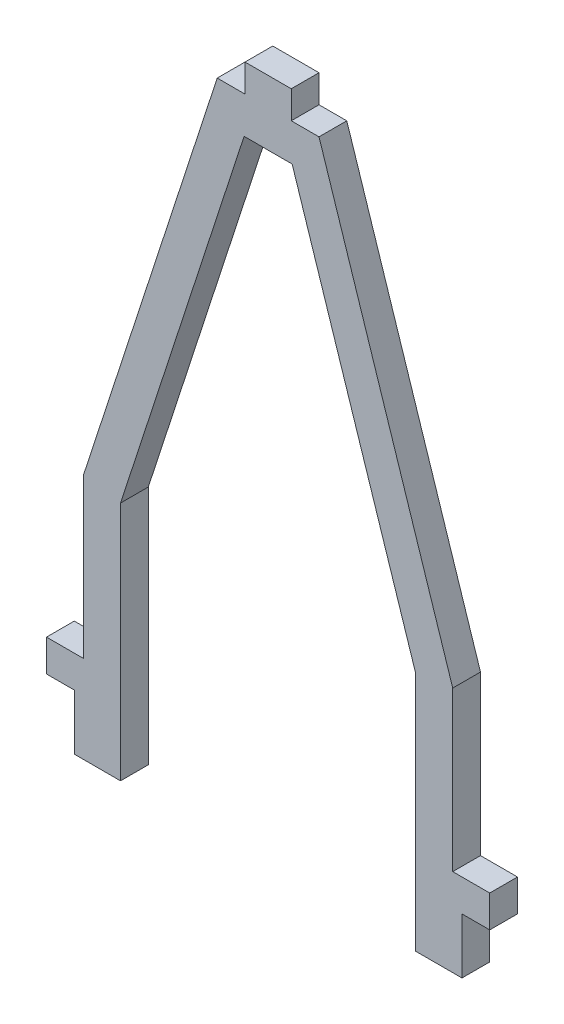
ISO-10303-21;
HEADER;
FILE_DESCRIPTION(('STEP AP214'),'2;1');
FILE_NAME('part.step','',(''),(''),'','','');
FILE_SCHEMA(('AUTOMOTIVE_DESIGN { 1 0 10303 214 1 1 1 1 }'));
ENDSEC;
DATA;
#1=APPLICATION_CONTEXT('core data for automotive mechanical design processes');
#2=APPLICATION_PROTOCOL_DEFINITION('international standard','automotive_design',2000,#1);
#3=PRODUCT_CONTEXT('',#1,'mechanical');
#4=PRODUCT('Part','Part','',(#3));
#5=PRODUCT_RELATED_PRODUCT_CATEGORY('part','',(#4));
#6=PRODUCT_DEFINITION_FORMATION('','',#4);
#7=PRODUCT_DEFINITION_CONTEXT('part definition',#1,'design');
#8=PRODUCT_DEFINITION('design','',#6,#7);
#9=PRODUCT_DEFINITION_SHAPE('','',#8);
#10=(LENGTH_UNIT() NAMED_UNIT(*) SI_UNIT(.MILLI.,.METRE.));
#11=(NAMED_UNIT(*) PLANE_ANGLE_UNIT() SI_UNIT($,.RADIAN.));
#12=(NAMED_UNIT(*) SI_UNIT($,.STERADIAN.) SOLID_ANGLE_UNIT());
#13=UNCERTAINTY_MEASURE_WITH_UNIT(LENGTH_MEASURE(1.E-05),#10,'distance_accuracy_value','');
#14=(GEOMETRIC_REPRESENTATION_CONTEXT(3) GLOBAL_UNCERTAINTY_ASSIGNED_CONTEXT((#13)) GLOBAL_UNIT_ASSIGNED_CONTEXT((#10,
#11,#12)) REPRESENTATION_CONTEXT('',''));
#15=CARTESIAN_POINT('',(0.,0.,0.));
#16=DIRECTION('',(0.,0.,1.));
#17=DIRECTION('',(1.,0.,0.));
#18=AXIS2_PLACEMENT_3D('',#15,#16,#17);
#19=CARTESIAN_POINT('',(-11.3838944067184,-69.0934410290351,3.));
#20=DIRECTION('',(0.,1.,0.));
#21=DIRECTION('',(0.,0.,1.));
#22=AXIS2_PLACEMENT_3D('',#19,#20,#21);
#23=PLANE('',#22);
#24=DIRECTION('',(1.,0.,0.));
#25=VECTOR('',#24,1.);
#26=CARTESIAN_POINT('',(-11.3838944067184,-69.0934410290351,0.));
#27=LINE('',#26,#25);
#28=CARTESIAN_POINT('',(-11.3838944067184,-69.0934410290351,0.));
#29=VERTEX_POINT('',#28);
#30=CARTESIAN_POINT('',(-6.38389440671836,-69.0934410290351,0.));
#31=VERTEX_POINT('',#30);
#32=EDGE_CURVE('E225',#29,#31,#27,.T.);
#33=ORIENTED_EDGE('',*,*,#32,.T.);
#34=DIRECTION('',(0.,0.,-1.));
#35=VECTOR('',#34,1.);
#36=CARTESIAN_POINT('',(-6.38389440671836,-69.0934410290351,3.));
#37=LINE('',#36,#35);
#38=CARTESIAN_POINT('',(-6.38389440671836,-69.0934410290351,3.));
#39=VERTEX_POINT('',#38);
#40=EDGE_CURVE('E11',#39,#31,#37,.T.);
#41=ORIENTED_EDGE('',*,*,#40,.F.);
#42=DIRECTION('',(1.,0.,0.));
#43=VECTOR('',#42,1.);
#44=CARTESIAN_POINT('',(-11.3838944067184,-69.0934410290351,3.));
#45=LINE('',#44,#43);
#46=CARTESIAN_POINT('',(-11.3838944067184,-69.0934410290351,3.));
#47=VERTEX_POINT('',#46);
#48=EDGE_CURVE('E271',#47,#39,#45,.T.);
#49=ORIENTED_EDGE('',*,*,#48,.F.);
#50=DIRECTION('',(0.,0.,-1.));
#51=VECTOR('',#50,1.);
#52=CARTESIAN_POINT('',(-11.3838944067184,-69.0934410290351,3.));
#53=LINE('',#52,#51);
#54=EDGE_CURVE('E221',#47,#29,#53,.T.);
#55=ORIENTED_EDGE('',*,*,#54,.T.);
#56=EDGE_LOOP('',(#33,#41,#49,#55));
#57=FACE_BOUND('',#56,.T.);
#58=ADVANCED_FACE('F33',(#57),#23,.F.);
#59=CARTESIAN_POINT('',(-6.38389440671836,-69.0934410290351,3.));
#60=DIRECTION('',(-1.,0.,0.));
#61=DIRECTION('',(0.,-1.,0.));
#62=AXIS2_PLACEMENT_3D('',#59,#60,#61);
#63=PLANE('',#62);
#64=DIRECTION('',(0.,1.,0.));
#65=VECTOR('',#64,1.);
#66=CARTESIAN_POINT('',(-6.38389440671836,-69.0934410290351,0.));
#67=LINE('',#66,#65);
#68=CARTESIAN_POINT('',(-6.38389440671835,-43.0934410290351,0.));
#69=VERTEX_POINT('',#68);
#70=EDGE_CURVE('E228',#31,#69,#67,.T.);
#71=ORIENTED_EDGE('',*,*,#70,.T.);
#72=DIRECTION('',(0.,0.,-1.));
#73=VECTOR('',#72,1.);
#74=CARTESIAN_POINT('',(-6.38389440671835,-43.0934410290351,3.));
#75=LINE('',#74,#73);
#76=CARTESIAN_POINT('',(-6.38389440671835,-43.0934410290351,3.));
#77=VERTEX_POINT('',#76);
#78=EDGE_CURVE('E41',#77,#69,#75,.T.);
#79=ORIENTED_EDGE('',*,*,#78,.F.);
#80=DIRECTION('',(0.,1.,0.));
#81=VECTOR('',#80,1.);
#82=CARTESIAN_POINT('',(-6.38389440671836,-69.0934410290351,3.));
#83=LINE('',#82,#81);
#84=EDGE_CURVE('E140',#39,#77,#83,.T.);
#85=ORIENTED_EDGE('',*,*,#84,.F.);
#86=ORIENTED_EDGE('',*,*,#40,.T.);
#87=EDGE_LOOP('',(#71,#79,#85,#86));
#88=FACE_BOUND('',#87,.T.);
#89=ADVANCED_FACE('F409',(#88),#63,.F.);
#90=CARTESIAN_POINT('',(-6.38389440671835,-43.0934410290351,3.));
#91=DIRECTION('',(-0.95083621614684,0.309694187971877,0.));
#92=DIRECTION('',(-0.309694187971877,-0.95083621614684,0.));
#93=AXIS2_PLACEMENT_3D('',#90,#91,#92);
#94=PLANE('',#93);
#95=DIRECTION('',(0.309694187971877,0.95083621614684,0.));
#96=VECTOR('',#95,1.);
#97=CARTESIAN_POINT('',(-6.38389440671835,-43.0934410290351,0.));
#98=LINE('',#97,#96);
#99=CARTESIAN_POINT('',(6.97010020478482,-2.09344102903508,0.));
#100=VERTEX_POINT('',#99);
#101=EDGE_CURVE('E230',#69,#100,#98,.T.);
#102=ORIENTED_EDGE('',*,*,#101,.T.);
#103=DIRECTION('',(0.,0.,-1.));
#104=VECTOR('',#103,1.);
#105=CARTESIAN_POINT('',(6.97010020478482,-2.09344102903508,3.));
#106=LINE('',#105,#104);
#107=CARTESIAN_POINT('',(6.97010020478482,-2.09344102903508,3.));
#108=VERTEX_POINT('',#107);
#109=EDGE_CURVE('E326',#108,#100,#106,.T.);
#110=ORIENTED_EDGE('',*,*,#109,.F.);
#111=DIRECTION('',(0.309694187971877,0.95083621614684,0.));
#112=VECTOR('',#111,1.);
#113=CARTESIAN_POINT('',(-6.38389440671835,-43.0934410290351,3.));
#114=LINE('',#113,#112);
#115=EDGE_CURVE('E334',#77,#108,#114,.T.);
#116=ORIENTED_EDGE('',*,*,#115,.F.);
#117=ORIENTED_EDGE('',*,*,#78,.T.);
#118=EDGE_LOOP('',(#102,#110,#116,#117));
#119=FACE_BOUND('',#118,.T.);
#120=ADVANCED_FACE('F332',(#119),#94,.F.);
#121=CARTESIAN_POINT('',(6.97010020478482,-2.09344102903508,3.));
#122=DIRECTION('',(0.,1.,0.));
#123=DIRECTION('',(0.,0.,1.));
#124=AXIS2_PLACEMENT_3D('',#121,#122,#123);
#125=PLANE('',#124);
#126=DIRECTION('',(1.,0.,0.));
#127=VECTOR('',#126,1.);
#128=CARTESIAN_POINT('',(6.97010020478482,-2.09344102903508,0.));
#129=LINE('',#128,#127);
#130=CARTESIAN_POINT('',(12.1621109817785,-2.09344102903508,0.));
#131=VERTEX_POINT('',#130);
#132=EDGE_CURVE('E232',#100,#131,#129,.T.);
#133=ORIENTED_EDGE('',*,*,#132,.T.);
#134=DIRECTION('',(0.,0.,-1.));
#135=VECTOR('',#134,1.);
#136=CARTESIAN_POINT('',(12.1621109817785,-2.09344102903508,3.));
#137=LINE('',#136,#135);
#138=CARTESIAN_POINT('',(12.1621109817785,-2.09344102903508,3.));
#139=VERTEX_POINT('',#138);
#140=EDGE_CURVE('E323',#139,#131,#137,.T.);
#141=ORIENTED_EDGE('',*,*,#140,.F.);
#142=DIRECTION('',(1.,0.,0.));
#143=VECTOR('',#142,1.);
#144=CARTESIAN_POINT('',(6.97010020478482,-2.09344102903508,3.));
#145=LINE('',#144,#143);
#146=EDGE_CURVE('E352',#108,#139,#145,.T.);
#147=ORIENTED_EDGE('',*,*,#146,.F.);
#148=ORIENTED_EDGE('',*,*,#109,.T.);
#149=EDGE_LOOP('',(#133,#141,#147,#148));
#150=FACE_BOUND('',#149,.T.);
#151=ADVANCED_FACE('F343',(#150),#125,.F.);
#152=CARTESIAN_POINT('',(25.5161055932816,-43.0934410290351,3.));
#153=DIRECTION('',(0.95083621614684,0.309694187971877,0.));
#154=DIRECTION('',(-0.309694187971877,0.95083621614684,0.));
#155=AXIS2_PLACEMENT_3D('',#152,#153,#154);
#156=PLANE('',#155);
#157=DIRECTION('',(0.309694187971877,-0.95083621614684,0.));
#158=VECTOR('',#157,1.);
#159=CARTESIAN_POINT('',(25.5161055932816,-43.0934410290351,0.));
#160=LINE('',#159,#158);
#161=CARTESIAN_POINT('',(25.5161055932816,-43.0934410290351,0.));
#162=VERTEX_POINT('',#161);
#163=EDGE_CURVE('E234',#131,#162,#160,.T.);
#164=ORIENTED_EDGE('',*,*,#163,.T.);
#165=DIRECTION('',(0.,0.,-1.));
#166=VECTOR('',#165,1.);
#167=CARTESIAN_POINT('',(25.5161055932816,-43.0934410290351,3.));
#168=LINE('',#167,#166);
#169=CARTESIAN_POINT('',(25.5161055932816,-43.0934410290351,3.));
#170=VERTEX_POINT('',#169);
#171=EDGE_CURVE('E320',#170,#162,#168,.T.);
#172=ORIENTED_EDGE('',*,*,#171,.F.);
#173=DIRECTION('',(0.309694187971877,-0.95083621614684,0.));
#174=VECTOR('',#173,1.);
#175=CARTESIAN_POINT('',(25.5161055932816,-43.0934410290351,3.));
#176=LINE('',#175,#174);
#177=EDGE_CURVE('E349',#139,#170,#176,.T.);
#178=ORIENTED_EDGE('',*,*,#177,.F.);
#179=ORIENTED_EDGE('',*,*,#140,.T.);
#180=EDGE_LOOP('',(#164,#172,#178,#179));
#181=FACE_BOUND('',#180,.T.);
#182=ADVANCED_FACE('F347',(#181),#156,.F.);
#183=CARTESIAN_POINT('',(25.5161055932816,-69.0934410290351,3.));
#184=DIRECTION('',(1.,0.,0.));
#185=DIRECTION('',(0.,0.,-1.));
#186=AXIS2_PLACEMENT_3D('',#183,#184,#185);
#187=PLANE('',#186);
#188=DIRECTION('',(0.,-1.,0.));
#189=VECTOR('',#188,1.);
#190=CARTESIAN_POINT('',(25.5161055932816,-69.0934410290351,0.));
#191=LINE('',#190,#189);
#192=CARTESIAN_POINT('',(25.5161055932816,-69.0934410290351,0.));
#193=VERTEX_POINT('',#192);
#194=EDGE_CURVE('E236',#162,#193,#191,.T.);
#195=ORIENTED_EDGE('',*,*,#194,.T.);
#196=DIRECTION('',(0.,0.,-1.));
#197=VECTOR('',#196,1.);
#198=CARTESIAN_POINT('',(25.5161055932816,-69.0934410290351,3.));
#199=LINE('',#198,#197);
#200=CARTESIAN_POINT('',(25.5161055932816,-69.0934410290351,3.));
#201=VERTEX_POINT('',#200);
#202=EDGE_CURVE('E317',#201,#193,#199,.T.);
#203=ORIENTED_EDGE('',*,*,#202,.F.);
#204=DIRECTION('',(0.,-1.,0.));
#205=VECTOR('',#204,1.);
#206=CARTESIAN_POINT('',(25.5161055932816,-69.0934410290351,3.));
#207=LINE('',#206,#205);
#208=EDGE_CURVE('E351',#170,#201,#207,.T.);
#209=ORIENTED_EDGE('',*,*,#208,.F.);
#210=ORIENTED_EDGE('',*,*,#171,.T.);
#211=EDGE_LOOP('',(#195,#203,#209,#210));
#212=FACE_BOUND('',#211,.T.);
#213=ADVANCED_FACE('F422',(#212),#187,.F.);
#214=CARTESIAN_POINT('',(30.5161055932816,-69.0934410290351,3.));
#215=DIRECTION('',(0.,1.,0.));
#216=DIRECTION('',(0.,0.,1.));
#217=AXIS2_PLACEMENT_3D('',#214,#215,#216);
#218=PLANE('',#217);
#219=DIRECTION('',(1.,0.,0.));
#220=VECTOR('',#219,1.);
#221=CARTESIAN_POINT('',(30.5161055932816,-69.0934410290351,0.));
#222=LINE('',#221,#220);
#223=CARTESIAN_POINT('',(30.5161055932816,-69.0934410290351,0.));
#224=VERTEX_POINT('',#223);
#225=EDGE_CURVE('E238',#193,#224,#222,.T.);
#226=ORIENTED_EDGE('',*,*,#225,.T.);
#227=DIRECTION('',(0.,0.,-1.));
#228=VECTOR('',#227,1.);
#229=CARTESIAN_POINT('',(30.5161055932816,-69.0934410290351,3.));
#230=LINE('',#229,#228);
#231=CARTESIAN_POINT('',(30.5161055932816,-69.0934410290351,3.));
#232=VERTEX_POINT('',#231);
#233=EDGE_CURVE('E314',#232,#224,#230,.T.);
#234=ORIENTED_EDGE('',*,*,#233,.F.);
#235=DIRECTION('',(1.,0.,0.));
#236=VECTOR('',#235,1.);
#237=CARTESIAN_POINT('',(30.5161055932816,-69.0934410290351,3.));
#238=LINE('',#237,#236);
#239=EDGE_CURVE('E354',#201,#232,#238,.T.);
#240=ORIENTED_EDGE('',*,*,#239,.F.);
#241=ORIENTED_EDGE('',*,*,#202,.T.);
#242=EDGE_LOOP('',(#226,#234,#240,#241));
#243=FACE_BOUND('',#242,.T.);
#244=ADVANCED_FACE('F425',(#243),#218,.F.);
#245=CARTESIAN_POINT('',(30.5161055932816,-63.0934410290351,3.));
#246=DIRECTION('',(-1.,0.,0.));
#247=DIRECTION('',(0.,-1.,0.));
#248=AXIS2_PLACEMENT_3D('',#245,#246,#247);
#249=PLANE('',#248);
#250=DIRECTION('',(0.,1.,0.));
#251=VECTOR('',#250,1.);
#252=CARTESIAN_POINT('',(30.5161055932816,-63.0934410290351,0.));
#253=LINE('',#252,#251);
#254=CARTESIAN_POINT('',(30.5161055932816,-63.0934410290351,0.));
#255=VERTEX_POINT('',#254);
#256=EDGE_CURVE('E240',#224,#255,#253,.T.);
#257=ORIENTED_EDGE('',*,*,#256,.T.);
#258=DIRECTION('',(0.,0.,-1.));
#259=VECTOR('',#258,1.);
#260=CARTESIAN_POINT('',(30.5161055932816,-63.0934410290351,3.));
#261=LINE('',#260,#259);
#262=CARTESIAN_POINT('',(30.5161055932816,-63.0934410290351,3.));
#263=VERTEX_POINT('',#262);
#264=EDGE_CURVE('E311',#263,#255,#261,.T.);
#265=ORIENTED_EDGE('',*,*,#264,.F.);
#266=DIRECTION('',(0.,1.,0.));
#267=VECTOR('',#266,1.);
#268=CARTESIAN_POINT('',(30.5161055932816,-63.0934410290351,3.));
#269=LINE('',#268,#267);
#270=EDGE_CURVE('E360',#232,#263,#269,.T.);
#271=ORIENTED_EDGE('',*,*,#270,.F.);
#272=ORIENTED_EDGE('',*,*,#233,.T.);
#273=EDGE_LOOP('',(#257,#265,#271,#272));
#274=FACE_BOUND('',#273,.T.);
#275=ADVANCED_FACE('F429',(#274),#249,.F.);
#276=CARTESIAN_POINT('',(33.5161055932816,-63.0934410290351,3.));
#277=DIRECTION('',(0.,1.,0.));
#278=DIRECTION('',(0.,0.,1.));
#279=AXIS2_PLACEMENT_3D('',#276,#277,#278);
#280=PLANE('',#279);
#281=DIRECTION('',(1.,0.,0.));
#282=VECTOR('',#281,1.);
#283=CARTESIAN_POINT('',(33.5161055932816,-63.0934410290351,0.));
#284=LINE('',#283,#282);
#285=CARTESIAN_POINT('',(33.5161055932816,-63.0934410290351,0.));
#286=VERTEX_POINT('',#285);
#287=EDGE_CURVE('E242',#255,#286,#284,.T.);
#288=ORIENTED_EDGE('',*,*,#287,.T.);
#289=DIRECTION('',(0.,0.,-1.));
#290=VECTOR('',#289,1.);
#291=CARTESIAN_POINT('',(33.5161055932816,-63.0934410290351,3.));
#292=LINE('',#291,#290);
#293=CARTESIAN_POINT('',(33.5161055932816,-63.0934410290351,3.));
#294=VERTEX_POINT('',#293);
#295=EDGE_CURVE('E308',#294,#286,#292,.T.);
#296=ORIENTED_EDGE('',*,*,#295,.F.);
#297=DIRECTION('',(1.,0.,0.));
#298=VECTOR('',#297,1.);
#299=CARTESIAN_POINT('',(33.5161055932816,-63.0934410290351,3.));
#300=LINE('',#299,#298);
#301=EDGE_CURVE('E362',#263,#294,#300,.T.);
#302=ORIENTED_EDGE('',*,*,#301,.F.);
#303=ORIENTED_EDGE('',*,*,#264,.T.);
#304=EDGE_LOOP('',(#288,#296,#302,#303));
#305=FACE_BOUND('',#304,.T.);
#306=ADVANCED_FACE('F433',(#305),#280,.F.);
#307=CARTESIAN_POINT('',(33.5161055932816,-59.6387698880339,3.));
#308=DIRECTION('',(-1.,0.,0.));
#309=DIRECTION('',(0.,0.,1.));
#310=AXIS2_PLACEMENT_3D('',#307,#308,#309);
#311=PLANE('',#310);
#312=DIRECTION('',(0.,1.,0.));
#313=VECTOR('',#312,1.);
#314=CARTESIAN_POINT('',(33.5161055932816,-59.6387698880339,0.));
#315=LINE('',#314,#313);
#316=CARTESIAN_POINT('',(33.5161055932816,-59.6387698880339,0.));
#317=VERTEX_POINT('',#316);
#318=EDGE_CURVE('E244',#286,#317,#315,.T.);
#319=ORIENTED_EDGE('',*,*,#318,.T.);
#320=DIRECTION('',(0.,0.,-1.));
#321=VECTOR('',#320,1.);
#322=CARTESIAN_POINT('',(33.5161055932816,-59.6387698880339,3.));
#323=LINE('',#322,#321);
#324=CARTESIAN_POINT('',(33.5161055932816,-59.6387698880339,3.));
#325=VERTEX_POINT('',#324);
#326=EDGE_CURVE('E305',#325,#317,#323,.T.);
#327=ORIENTED_EDGE('',*,*,#326,.F.);
#328=DIRECTION('',(0.,1.,0.));
#329=VECTOR('',#328,1.);
#330=CARTESIAN_POINT('',(33.5161055932816,-59.6387698880339,3.));
#331=LINE('',#330,#329);
#332=EDGE_CURVE('E364',#294,#325,#331,.T.);
#333=ORIENTED_EDGE('',*,*,#332,.F.);
#334=ORIENTED_EDGE('',*,*,#295,.T.);
#335=EDGE_LOOP('',(#319,#327,#333,#334));
#336=FACE_BOUND('',#335,.T.);
#337=ADVANCED_FACE('F437',(#336),#311,.F.);
#338=CARTESIAN_POINT('',(29.5161055932816,-59.6387698880339,3.));
#339=DIRECTION('',(0.,-1.,0.));
#340=DIRECTION('',(0.,0.,-1.));
#341=AXIS2_PLACEMENT_3D('',#338,#339,#340);
#342=PLANE('',#341);
#343=DIRECTION('',(-1.,0.,0.));
#344=VECTOR('',#343,1.);
#345=CARTESIAN_POINT('',(29.5161055932816,-59.6387698880339,0.));
#346=LINE('',#345,#344);
#347=CARTESIAN_POINT('',(29.5161055932816,-59.6387698880339,0.));
#348=VERTEX_POINT('',#347);
#349=EDGE_CURVE('E246',#317,#348,#346,.T.);
#350=ORIENTED_EDGE('',*,*,#349,.T.);
#351=DIRECTION('',(0.,0.,-1.));
#352=VECTOR('',#351,1.);
#353=CARTESIAN_POINT('',(29.5161055932816,-59.6387698880339,3.));
#354=LINE('',#353,#352);
#355=CARTESIAN_POINT('',(29.5161055932816,-59.6387698880339,3.));
#356=VERTEX_POINT('',#355);
#357=EDGE_CURVE('E302',#356,#348,#354,.T.);
#358=ORIENTED_EDGE('',*,*,#357,.F.);
#359=DIRECTION('',(-1.,0.,0.));
#360=VECTOR('',#359,1.);
#361=CARTESIAN_POINT('',(29.5161055932816,-59.6387698880339,3.));
#362=LINE('',#361,#360);
#363=EDGE_CURVE('E366',#325,#356,#362,.T.);
#364=ORIENTED_EDGE('',*,*,#363,.F.);
#365=ORIENTED_EDGE('',*,*,#326,.T.);
#366=EDGE_LOOP('',(#350,#358,#364,#365));
#367=FACE_BOUND('',#366,.T.);
#368=ADVANCED_FACE('F441',(#367),#342,.F.);
#369=CARTESIAN_POINT('',(29.5161055932816,-42.4584432052125,3.));
#370=DIRECTION('',(-1.,0.,0.));
#371=DIRECTION('',(0.,-1.,0.));
#372=AXIS2_PLACEMENT_3D('',#369,#370,#371);
#373=PLANE('',#372);
#374=DIRECTION('',(0.,1.,0.));
#375=VECTOR('',#374,1.);
#376=CARTESIAN_POINT('',(29.5161055932816,-42.4584432052125,0.));
#377=LINE('',#376,#375);
#378=CARTESIAN_POINT('',(29.5161055932816,-42.4584432052125,0.));
#379=VERTEX_POINT('',#378);
#380=EDGE_CURVE('E248',#348,#379,#377,.T.);
#381=ORIENTED_EDGE('',*,*,#380,.T.);
#382=DIRECTION('',(0.,0.,-1.));
#383=VECTOR('',#382,1.);
#384=CARTESIAN_POINT('',(29.5161055932816,-42.4584432052125,3.));
#385=LINE('',#384,#383);
#386=CARTESIAN_POINT('',(29.5161055932816,-42.4584432052125,3.));
#387=VERTEX_POINT('',#386);
#388=EDGE_CURVE('E299',#387,#379,#385,.T.);
#389=ORIENTED_EDGE('',*,*,#388,.F.);
#390=DIRECTION('',(0.,1.,0.));
#391=VECTOR('',#390,1.);
#392=CARTESIAN_POINT('',(29.5161055932816,-42.4584432052125,3.));
#393=LINE('',#392,#391);
#394=EDGE_CURVE('E368',#356,#387,#393,.T.);
#395=ORIENTED_EDGE('',*,*,#394,.F.);
#396=ORIENTED_EDGE('',*,*,#357,.T.);
#397=EDGE_LOOP('',(#381,#389,#395,#396));
#398=FACE_BOUND('',#397,.T.);
#399=ADVANCED_FACE('F445',(#398),#373,.F.);
#400=CARTESIAN_POINT('',(15.0661055932816,1.90655897096492,3.));
#401=DIRECTION('',(-0.95083621614684,-0.309694187971877,0.));
#402=DIRECTION('',(0.309694187971877,-0.95083621614684,0.));
#403=AXIS2_PLACEMENT_3D('',#400,#401,#402);
#404=PLANE('',#403);
#405=DIRECTION('',(-0.309694187971877,0.95083621614684,0.));
#406=VECTOR('',#405,1.);
#407=CARTESIAN_POINT('',(15.0661055932816,1.90655897096492,0.));
#408=LINE('',#407,#406);
#409=CARTESIAN_POINT('',(15.0661055932816,1.90655897096492,0.));
#410=VERTEX_POINT('',#409);
#411=EDGE_CURVE('E250',#379,#410,#408,.T.);
#412=ORIENTED_EDGE('',*,*,#411,.T.);
#413=DIRECTION('',(0.,0.,-1.));
#414=VECTOR('',#413,1.);
#415=CARTESIAN_POINT('',(15.0661055932816,1.90655897096492,3.));
#416=LINE('',#415,#414);
#417=CARTESIAN_POINT('',(15.0661055932816,1.90655897096492,3.));
#418=VERTEX_POINT('',#417);
#419=EDGE_CURVE('E296',#418,#410,#416,.T.);
#420=ORIENTED_EDGE('',*,*,#419,.F.);
#421=DIRECTION('',(-0.309694187971877,0.95083621614684,0.));
#422=VECTOR('',#421,1.);
#423=CARTESIAN_POINT('',(15.0661055932816,1.90655897096492,3.));
#424=LINE('',#423,#422);
#425=EDGE_CURVE('E370',#387,#418,#424,.T.);
#426=ORIENTED_EDGE('',*,*,#425,.F.);
#427=ORIENTED_EDGE('',*,*,#388,.T.);
#428=EDGE_LOOP('',(#412,#420,#426,#427));
#429=FACE_BOUND('',#428,.T.);
#430=ADVANCED_FACE('F449',(#429),#404,.F.);
#431=CARTESIAN_POINT('',(12.0661055932816,1.90655897096492,3.));
#432=DIRECTION('',(0.,-1.,0.));
#433=DIRECTION('',(1.,0.,0.));
#434=AXIS2_PLACEMENT_3D('',#431,#432,#433);
#435=PLANE('',#434);
#436=DIRECTION('',(-1.,0.,0.));
#437=VECTOR('',#436,1.);
#438=CARTESIAN_POINT('',(12.0661055932816,1.90655897096492,0.));
#439=LINE('',#438,#437);
#440=CARTESIAN_POINT('',(12.0661055932816,1.90655897096492,0.));
#441=VERTEX_POINT('',#440);
#442=EDGE_CURVE('E252',#410,#441,#439,.T.);
#443=ORIENTED_EDGE('',*,*,#442,.T.);
#444=DIRECTION('',(0.,0.,-1.));
#445=VECTOR('',#444,1.);
#446=CARTESIAN_POINT('',(12.0661055932816,1.90655897096492,3.));
#447=LINE('',#446,#445);
#448=CARTESIAN_POINT('',(12.0661055932816,1.90655897096492,3.));
#449=VERTEX_POINT('',#448);
#450=EDGE_CURVE('E293',#449,#441,#447,.T.);
#451=ORIENTED_EDGE('',*,*,#450,.F.);
#452=DIRECTION('',(-1.,0.,0.));
#453=VECTOR('',#452,1.);
#454=CARTESIAN_POINT('',(12.0661055932816,1.90655897096492,3.));
#455=LINE('',#454,#453);
#456=EDGE_CURVE('E372',#418,#449,#455,.T.);
#457=ORIENTED_EDGE('',*,*,#456,.F.);
#458=ORIENTED_EDGE('',*,*,#419,.T.);
#459=EDGE_LOOP('',(#443,#451,#457,#458));
#460=FACE_BOUND('',#459,.T.);
#461=ADVANCED_FACE('F453',(#460),#435,.F.);
#462=CARTESIAN_POINT('',(12.0661055932816,4.90655897096492,3.));
#463=DIRECTION('',(-1.,0.,0.));
#464=DIRECTION('',(0.,-1.,0.));
#465=AXIS2_PLACEMENT_3D('',#462,#463,#464);
#466=PLANE('',#465);
#467=DIRECTION('',(0.,1.,0.));
#468=VECTOR('',#467,1.);
#469=CARTESIAN_POINT('',(12.0661055932816,4.90655897096492,0.));
#470=LINE('',#469,#468);
#471=CARTESIAN_POINT('',(12.0661055932816,4.90655897096492,0.));
#472=VERTEX_POINT('',#471);
#473=EDGE_CURVE('E254',#441,#472,#470,.T.);
#474=ORIENTED_EDGE('',*,*,#473,.T.);
#475=DIRECTION('',(0.,0.,-1.));
#476=VECTOR('',#475,1.);
#477=CARTESIAN_POINT('',(12.0661055932816,4.90655897096492,3.));
#478=LINE('',#477,#476);
#479=CARTESIAN_POINT('',(12.0661055932816,4.90655897096492,3.));
#480=VERTEX_POINT('',#479);
#481=EDGE_CURVE('E290',#480,#472,#478,.T.);
#482=ORIENTED_EDGE('',*,*,#481,.F.);
#483=DIRECTION('',(0.,1.,0.));
#484=VECTOR('',#483,1.);
#485=CARTESIAN_POINT('',(12.0661055932816,4.90655897096492,3.));
#486=LINE('',#485,#484);
#487=EDGE_CURVE('E374',#449,#480,#486,.T.);
#488=ORIENTED_EDGE('',*,*,#487,.F.);
#489=ORIENTED_EDGE('',*,*,#450,.T.);
#490=EDGE_LOOP('',(#474,#482,#488,#489));
#491=FACE_BOUND('',#490,.T.);
#492=ADVANCED_FACE('F457',(#491),#466,.F.);
#493=CARTESIAN_POINT('',(7.06610559328164,4.90655897096492,3.));
#494=DIRECTION('',(0.,-1.,0.));
#495=DIRECTION('',(0.,0.,-1.));
#496=AXIS2_PLACEMENT_3D('',#493,#494,#495);
#497=PLANE('',#496);
#498=DIRECTION('',(-1.,0.,0.));
#499=VECTOR('',#498,1.);
#500=CARTESIAN_POINT('',(7.06610559328164,4.90655897096492,0.));
#501=LINE('',#500,#499);
#502=CARTESIAN_POINT('',(7.06610559328164,4.90655897096492,0.));
#503=VERTEX_POINT('',#502);
#504=EDGE_CURVE('E256',#472,#503,#501,.T.);
#505=ORIENTED_EDGE('',*,*,#504,.T.);
#506=DIRECTION('',(0.,0.,-1.));
#507=VECTOR('',#506,1.);
#508=CARTESIAN_POINT('',(7.06610559328164,4.90655897096492,3.));
#509=LINE('',#508,#507);
#510=CARTESIAN_POINT('',(7.06610559328164,4.90655897096492,3.));
#511=VERTEX_POINT('',#510);
#512=EDGE_CURVE('E287',#511,#503,#509,.T.);
#513=ORIENTED_EDGE('',*,*,#512,.F.);
#514=DIRECTION('',(-1.,0.,0.));
#515=VECTOR('',#514,1.);
#516=CARTESIAN_POINT('',(7.06610559328164,4.90655897096492,3.));
#517=LINE('',#516,#515);
#518=EDGE_CURVE('E376',#480,#511,#517,.T.);
#519=ORIENTED_EDGE('',*,*,#518,.F.);
#520=ORIENTED_EDGE('',*,*,#481,.T.);
#521=EDGE_LOOP('',(#505,#513,#519,#520));
#522=FACE_BOUND('',#521,.T.);
#523=ADVANCED_FACE('F461',(#522),#497,.F.);
#524=CARTESIAN_POINT('',(7.06610559328164,4.90655897096492,3.));
#525=DIRECTION('',(1.,0.,0.));
#526=DIRECTION('',(0.,1.,0.));
#527=AXIS2_PLACEMENT_3D('',#524,#525,#526);
#528=PLANE('',#527);
#529=DIRECTION('',(0.,-1.,0.));
#530=VECTOR('',#529,1.);
#531=CARTESIAN_POINT('',(7.06610559328164,4.90655897096492,0.));
#532=LINE('',#531,#530);
#533=CARTESIAN_POINT('',(7.06610559328164,1.90655897096492,0.));
#534=VERTEX_POINT('',#533);
#535=EDGE_CURVE('E258',#503,#534,#532,.T.);
#536=ORIENTED_EDGE('',*,*,#535,.T.);
#537=DIRECTION('',(0.,0.,-1.));
#538=VECTOR('',#537,1.);
#539=CARTESIAN_POINT('',(7.06610559328164,1.90655897096492,3.));
#540=LINE('',#539,#538);
#541=CARTESIAN_POINT('',(7.06610559328164,1.90655897096492,3.));
#542=VERTEX_POINT('',#541);
#543=EDGE_CURVE('E284',#542,#534,#540,.T.);
#544=ORIENTED_EDGE('',*,*,#543,.F.);
#545=DIRECTION('',(0.,-1.,0.));
#546=VECTOR('',#545,1.);
#547=CARTESIAN_POINT('',(7.06610559328164,4.90655897096492,3.));
#548=LINE('',#547,#546);
#549=EDGE_CURVE('E378',#511,#542,#548,.T.);
#550=ORIENTED_EDGE('',*,*,#549,.F.);
#551=ORIENTED_EDGE('',*,*,#512,.T.);
#552=EDGE_LOOP('',(#536,#544,#550,#551));
#553=FACE_BOUND('',#552,.T.);
#554=ADVANCED_FACE('F465',(#553),#528,.F.);
#555=CARTESIAN_POINT('',(4.06610559328164,1.90655897096492,3.));
#556=DIRECTION('',(0.,-1.,0.));
#557=DIRECTION('',(0.,0.,-1.));
#558=AXIS2_PLACEMENT_3D('',#555,#556,#557);
#559=PLANE('',#558);
#560=DIRECTION('',(-1.,0.,0.));
#561=VECTOR('',#560,1.);
#562=CARTESIAN_POINT('',(4.06610559328164,1.90655897096492,0.));
#563=LINE('',#562,#561);
#564=CARTESIAN_POINT('',(4.06610559328164,1.90655897096492,0.));
#565=VERTEX_POINT('',#564);
#566=EDGE_CURVE('E260',#534,#565,#563,.T.);
#567=ORIENTED_EDGE('',*,*,#566,.T.);
#568=DIRECTION('',(0.,0.,-1.));
#569=VECTOR('',#568,1.);
#570=CARTESIAN_POINT('',(4.06610559328164,1.90655897096492,3.));
#571=LINE('',#570,#569);
#572=CARTESIAN_POINT('',(4.06610559328164,1.90655897096492,3.));
#573=VERTEX_POINT('',#572);
#574=EDGE_CURVE('E281',#573,#565,#571,.T.);
#575=ORIENTED_EDGE('',*,*,#574,.F.);
#576=DIRECTION('',(-1.,0.,0.));
#577=VECTOR('',#576,1.);
#578=CARTESIAN_POINT('',(4.06610559328164,1.90655897096492,3.));
#579=LINE('',#578,#577);
#580=EDGE_CURVE('E380',#542,#573,#579,.T.);
#581=ORIENTED_EDGE('',*,*,#580,.F.);
#582=ORIENTED_EDGE('',*,*,#543,.T.);
#583=EDGE_LOOP('',(#567,#575,#581,#582));
#584=FACE_BOUND('',#583,.T.);
#585=ADVANCED_FACE('F469',(#584),#559,.F.);
#586=CARTESIAN_POINT('',(4.06610559328164,1.90655897096492,3.));
#587=DIRECTION('',(0.95083621614684,-0.309694187971877,0.));
#588=DIRECTION('',(0.309694187971877,0.95083621614684,0.));
#589=AXIS2_PLACEMENT_3D('',#586,#587,#588);
#590=PLANE('',#589);
#591=DIRECTION('',(-0.309694187971877,-0.95083621614684,0.));
#592=VECTOR('',#591,1.);
#593=CARTESIAN_POINT('',(4.06610559328164,1.90655897096492,0.));
#594=LINE('',#593,#592);
#595=CARTESIAN_POINT('',(-10.3838944067184,-42.4584432052125,0.));
#596=VERTEX_POINT('',#595);
#597=EDGE_CURVE('E262',#565,#596,#594,.T.);
#598=ORIENTED_EDGE('',*,*,#597,.T.);
#599=DIRECTION('',(0.,0.,-1.));
#600=VECTOR('',#599,1.);
#601=CARTESIAN_POINT('',(-10.3838944067184,-42.4584432052125,3.));
#602=LINE('',#601,#600);
#603=CARTESIAN_POINT('',(-10.3838944067184,-42.4584432052125,3.));
#604=VERTEX_POINT('',#603);
#605=EDGE_CURVE('E278',#604,#596,#602,.T.);
#606=ORIENTED_EDGE('',*,*,#605,.F.);
#607=DIRECTION('',(-0.309694187971877,-0.95083621614684,0.));
#608=VECTOR('',#607,1.);
#609=CARTESIAN_POINT('',(4.06610559328164,1.90655897096492,3.));
#610=LINE('',#609,#608);
#611=EDGE_CURVE('E382',#573,#604,#610,.T.);
#612=ORIENTED_EDGE('',*,*,#611,.F.);
#613=ORIENTED_EDGE('',*,*,#574,.T.);
#614=EDGE_LOOP('',(#598,#606,#612,#613));
#615=FACE_BOUND('',#614,.T.);
#616=ADVANCED_FACE('F473',(#615),#590,.F.);
#617=CARTESIAN_POINT('',(-10.3838944067184,-42.4584432052125,3.));
#618=DIRECTION('',(1.,0.,0.));
#619=DIRECTION('',(0.,1.,0.));
#620=AXIS2_PLACEMENT_3D('',#617,#618,#619);
#621=PLANE('',#620);
#622=DIRECTION('',(0.,-1.,0.));
#623=VECTOR('',#622,1.);
#624=CARTESIAN_POINT('',(-10.3838944067184,-42.4584432052125,0.));
#625=LINE('',#624,#623);
#626=CARTESIAN_POINT('',(-10.3838944067184,-59.6387698880339,0.));
#627=VERTEX_POINT('',#626);
#628=EDGE_CURVE('E264',#596,#627,#625,.T.);
#629=ORIENTED_EDGE('',*,*,#628,.T.);
#630=DIRECTION('',(0.,0.,-1.));
#631=VECTOR('',#630,1.);
#632=CARTESIAN_POINT('',(-10.3838944067184,-59.6387698880339,3.));
#633=LINE('',#632,#631);
#634=CARTESIAN_POINT('',(-10.3838944067184,-59.6387698880339,3.));
#635=VERTEX_POINT('',#634);
#636=EDGE_CURVE('E275',#635,#627,#633,.T.);
#637=ORIENTED_EDGE('',*,*,#636,.F.);
#638=DIRECTION('',(0.,-1.,0.));
#639=VECTOR('',#638,1.);
#640=CARTESIAN_POINT('',(-10.3838944067184,-42.4584432052125,3.));
#641=LINE('',#640,#639);
#642=EDGE_CURVE('E384',#604,#635,#641,.T.);
#643=ORIENTED_EDGE('',*,*,#642,.F.);
#644=ORIENTED_EDGE('',*,*,#605,.T.);
#645=EDGE_LOOP('',(#629,#637,#643,#644));
#646=FACE_BOUND('',#645,.T.);
#647=ADVANCED_FACE('F390',(#646),#621,.F.);
#648=CARTESIAN_POINT('',(-10.3838944067184,-59.6387698880339,3.));
#649=DIRECTION('',(0.,-1.,0.));
#650=DIRECTION('',(0.,0.,-1.));
#651=AXIS2_PLACEMENT_3D('',#648,#649,#650);
#652=PLANE('',#651);
#653=DIRECTION('',(-1.,0.,0.));
#654=VECTOR('',#653,1.);
#655=CARTESIAN_POINT('',(-10.3838944067184,-59.6387698880339,0.));
#656=LINE('',#655,#654);
#657=CARTESIAN_POINT('',(-14.3838944067184,-59.6387698880339,0.));
#658=VERTEX_POINT('',#657);
#659=EDGE_CURVE('E266',#627,#658,#656,.T.);
#660=ORIENTED_EDGE('',*,*,#659,.T.);
#661=DIRECTION('',(0.,0.,-1.));
#662=VECTOR('',#661,1.);
#663=CARTESIAN_POINT('',(-14.3838944067184,-59.6387698880339,3.));
#664=LINE('',#663,#662);
#665=CARTESIAN_POINT('',(-14.3838944067184,-59.6387698880339,3.));
#666=VERTEX_POINT('',#665);
#667=EDGE_CURVE('E216',#666,#658,#664,.T.);
#668=ORIENTED_EDGE('',*,*,#667,.F.);
#669=DIRECTION('',(-1.,0.,0.));
#670=VECTOR('',#669,1.);
#671=CARTESIAN_POINT('',(-10.3838944067184,-59.6387698880339,3.));
#672=LINE('',#671,#670);
#673=EDGE_CURVE('E207',#635,#666,#672,.T.);
#674=ORIENTED_EDGE('',*,*,#673,.F.);
#675=ORIENTED_EDGE('',*,*,#636,.T.);
#676=EDGE_LOOP('',(#660,#668,#674,#675));
#677=FACE_BOUND('',#676,.T.);
#678=ADVANCED_FACE('F394',(#677),#652,.F.);
#679=CARTESIAN_POINT('',(-14.3838944067184,-59.6387698880339,3.));
#680=DIRECTION('',(1.,0.,0.));
#681=DIRECTION('',(0.,0.,-1.));
#682=AXIS2_PLACEMENT_3D('',#679,#680,#681);
#683=PLANE('',#682);
#684=DIRECTION('',(0.,-1.,0.));
#685=VECTOR('',#684,1.);
#686=CARTESIAN_POINT('',(-14.3838944067184,-59.6387698880339,0.));
#687=LINE('',#686,#685);
#688=CARTESIAN_POINT('',(-14.3838944067184,-63.0934410290351,0.));
#689=VERTEX_POINT('',#688);
#690=EDGE_CURVE('E215',#658,#689,#687,.T.);
#691=ORIENTED_EDGE('',*,*,#690,.T.);
#692=DIRECTION('',(0.,0.,-1.));
#693=VECTOR('',#692,1.);
#694=CARTESIAN_POINT('',(-14.3838944067184,-63.0934410290351,3.));
#695=LINE('',#694,#693);
#696=CARTESIAN_POINT('',(-14.3838944067184,-63.0934410290351,3.));
#697=VERTEX_POINT('',#696);
#698=EDGE_CURVE('E212',#697,#689,#695,.T.);
#699=ORIENTED_EDGE('',*,*,#698,.F.);
#700=DIRECTION('',(0.,-1.,0.));
#701=VECTOR('',#700,1.);
#702=CARTESIAN_POINT('',(-14.3838944067184,-59.6387698880339,3.));
#703=LINE('',#702,#701);
#704=EDGE_CURVE('E201',#666,#697,#703,.T.);
#705=ORIENTED_EDGE('',*,*,#704,.F.);
#706=ORIENTED_EDGE('',*,*,#667,.T.);
#707=EDGE_LOOP('',(#691,#699,#705,#706));
#708=FACE_BOUND('',#707,.T.);
#709=ADVANCED_FACE('F213',(#708),#683,.F.);
#710=CARTESIAN_POINT('',(-14.3838944067184,-63.0934410290351,3.));
#711=DIRECTION('',(0.,1.,0.));
#712=DIRECTION('',(0.,0.,1.));
#713=AXIS2_PLACEMENT_3D('',#710,#711,#712);
#714=PLANE('',#713);
#715=DIRECTION('',(1.,0.,0.));
#716=VECTOR('',#715,1.);
#717=CARTESIAN_POINT('',(-14.3838944067184,-63.0934410290351,0.));
#718=LINE('',#717,#716);
#719=CARTESIAN_POINT('',(-11.3838944067184,-63.0934410290351,0.));
#720=VERTEX_POINT('',#719);
#721=EDGE_CURVE('E126',#689,#720,#718,.T.);
#722=ORIENTED_EDGE('',*,*,#721,.T.);
#723=DIRECTION('',(0.,0.,-1.));
#724=VECTOR('',#723,1.);
#725=CARTESIAN_POINT('',(-11.3838944067184,-63.0934410290351,3.));
#726=LINE('',#725,#724);
#727=CARTESIAN_POINT('',(-11.3838944067184,-63.0934410290351,3.));
#728=VERTEX_POINT('',#727);
#729=EDGE_CURVE('E217',#728,#720,#726,.T.);
#730=ORIENTED_EDGE('',*,*,#729,.F.);
#731=DIRECTION('',(1.,0.,0.));
#732=VECTOR('',#731,1.);
#733=CARTESIAN_POINT('',(-14.3838944067184,-63.0934410290351,3.));
#734=LINE('',#733,#732);
#735=EDGE_CURVE('E205',#697,#728,#734,.T.);
#736=ORIENTED_EDGE('',*,*,#735,.F.);
#737=ORIENTED_EDGE('',*,*,#698,.T.);
#738=EDGE_LOOP('',(#722,#730,#736,#737));
#739=FACE_BOUND('',#738,.T.);
#740=ADVANCED_FACE('F219',(#739),#714,.F.);
#741=CARTESIAN_POINT('',(-11.3838944067184,-63.0934410290351,3.));
#742=DIRECTION('',(1.,0.,0.));
#743=DIRECTION('',(0.,1.,0.));
#744=AXIS2_PLACEMENT_3D('',#741,#742,#743);
#745=PLANE('',#744);
#746=DIRECTION('',(0.,-1.,0.));
#747=VECTOR('',#746,1.);
#748=CARTESIAN_POINT('',(-11.3838944067184,-63.0934410290351,0.));
#749=LINE('',#748,#747);
#750=EDGE_CURVE('E132',#720,#29,#749,.T.);
#751=ORIENTED_EDGE('',*,*,#750,.T.);
#752=ORIENTED_EDGE('',*,*,#54,.F.);
#753=DIRECTION('',(0.,-1.,0.));
#754=VECTOR('',#753,1.);
#755=CARTESIAN_POINT('',(-11.3838944067184,-63.0934410290351,3.));
#756=LINE('',#755,#754);
#757=EDGE_CURVE('E49',#728,#47,#756,.T.);
#758=ORIENTED_EDGE('',*,*,#757,.F.);
#759=ORIENTED_EDGE('',*,*,#729,.T.);
#760=EDGE_LOOP('',(#751,#752,#758,#759));
#761=FACE_BOUND('',#760,.T.);
#762=ADVANCED_FACE('F398',(#761),#745,.F.);
#763=CARTESIAN_POINT('',(0.,0.,3.));
#764=DIRECTION('',(0.,0.,1.));
#765=DIRECTION('',(1.,0.,0.));
#766=AXIS2_PLACEMENT_3D('',#763,#764,#765);
#767=PLANE('',#766);
#768=ORIENTED_EDGE('',*,*,#48,.T.);
#769=ORIENTED_EDGE('',*,*,#84,.T.);
#770=ORIENTED_EDGE('',*,*,#115,.T.);
#771=ORIENTED_EDGE('',*,*,#146,.T.);
#772=ORIENTED_EDGE('',*,*,#177,.T.);
#773=ORIENTED_EDGE('',*,*,#208,.T.);
#774=ORIENTED_EDGE('',*,*,#239,.T.);
#775=ORIENTED_EDGE('',*,*,#270,.T.);
#776=ORIENTED_EDGE('',*,*,#301,.T.);
#777=ORIENTED_EDGE('',*,*,#332,.T.);
#778=ORIENTED_EDGE('',*,*,#363,.T.);
#779=ORIENTED_EDGE('',*,*,#394,.T.);
#780=ORIENTED_EDGE('',*,*,#425,.T.);
#781=ORIENTED_EDGE('',*,*,#456,.T.);
#782=ORIENTED_EDGE('',*,*,#487,.T.);
#783=ORIENTED_EDGE('',*,*,#518,.T.);
#784=ORIENTED_EDGE('',*,*,#549,.T.);
#785=ORIENTED_EDGE('',*,*,#580,.T.);
#786=ORIENTED_EDGE('',*,*,#611,.T.);
#787=ORIENTED_EDGE('',*,*,#642,.T.);
#788=ORIENTED_EDGE('',*,*,#673,.T.);
#789=ORIENTED_EDGE('',*,*,#704,.T.);
#790=ORIENTED_EDGE('',*,*,#735,.T.);
#791=ORIENTED_EDGE('',*,*,#757,.T.);
#792=EDGE_LOOP('',(#768,#769,#770,#771,#772,#773,#774,#775,#776,#777,#778,#779,#780,#781,#782,
#783,#784,#785,#786,#787,#788,#789,#790,#791));
#793=FACE_BOUND('',#792,.T.);
#794=ADVANCED_FACE('F203',(#793),#767,.T.);
#795=CARTESIAN_POINT('',(0.,0.,0.));
#796=DIRECTION('',(0.,0.,1.));
#797=DIRECTION('',(1.,0.,0.));
#798=AXIS2_PLACEMENT_3D('',#795,#796,#797);
#799=PLANE('',#798);
#800=ORIENTED_EDGE('',*,*,#32,.F.);
#801=ORIENTED_EDGE('',*,*,#750,.F.);
#802=ORIENTED_EDGE('',*,*,#721,.F.);
#803=ORIENTED_EDGE('',*,*,#690,.F.);
#804=ORIENTED_EDGE('',*,*,#659,.F.);
#805=ORIENTED_EDGE('',*,*,#628,.F.);
#806=ORIENTED_EDGE('',*,*,#597,.F.);
#807=ORIENTED_EDGE('',*,*,#566,.F.);
#808=ORIENTED_EDGE('',*,*,#535,.F.);
#809=ORIENTED_EDGE('',*,*,#504,.F.);
#810=ORIENTED_EDGE('',*,*,#473,.F.);
#811=ORIENTED_EDGE('',*,*,#442,.F.);
#812=ORIENTED_EDGE('',*,*,#411,.F.);
#813=ORIENTED_EDGE('',*,*,#380,.F.);
#814=ORIENTED_EDGE('',*,*,#349,.F.);
#815=ORIENTED_EDGE('',*,*,#318,.F.);
#816=ORIENTED_EDGE('',*,*,#287,.F.);
#817=ORIENTED_EDGE('',*,*,#256,.F.);
#818=ORIENTED_EDGE('',*,*,#225,.F.);
#819=ORIENTED_EDGE('',*,*,#194,.F.);
#820=ORIENTED_EDGE('',*,*,#163,.F.);
#821=ORIENTED_EDGE('',*,*,#132,.F.);
#822=ORIENTED_EDGE('',*,*,#101,.F.);
#823=ORIENTED_EDGE('',*,*,#70,.F.);
#824=EDGE_LOOP('',(#800,#801,#802,#803,#804,#805,#806,#807,#808,#809,#810,#811,#812,#813,#814,
#815,#816,#817,#818,#819,#820,#821,#822,#823));
#825=FACE_BOUND('',#824,.T.);
#826=ADVANCED_FACE('F338',(#825),#799,.F.);
#827=CLOSED_SHELL('',(#58,#89,#120,#151,#182,#213,#244,#275,#306,#337,#368,#399,#430,#461,#492,
#523,#554,#585,#616,#647,#678,#709,#740,#762,#794,#826));
#828=MANIFOLD_SOLID_BREP('B2',#827);
#829=ADVANCED_BREP_SHAPE_REPRESENTATION('',(#18,#828),#14);
#830=SHAPE_DEFINITION_REPRESENTATION(#9,#829);
ENDSEC;
END-ISO-10303-21;
